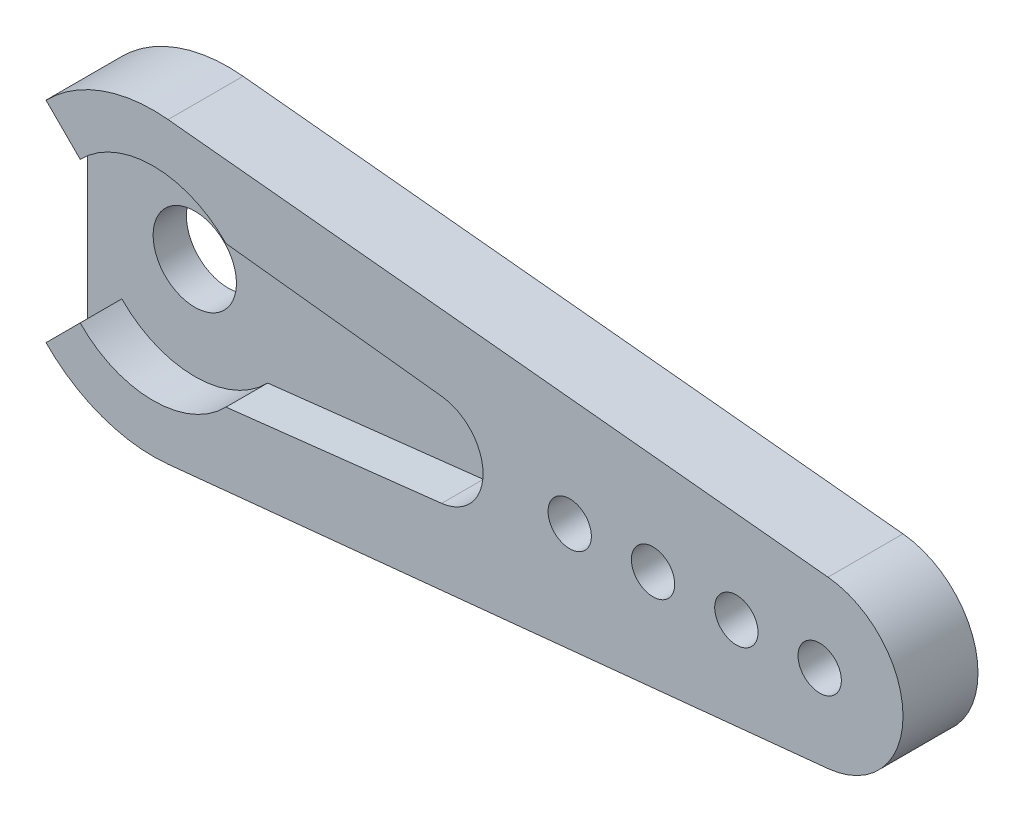
ISO-10303-21;
HEADER;
FILE_DESCRIPTION(('STEP AP214'),'2;1');
FILE_NAME('part.step','',(''),(''),'','','');
FILE_SCHEMA(('AUTOMOTIVE_DESIGN { 1 0 10303 214 1 1 1 1 }'));
ENDSEC;
DATA;
#1=APPLICATION_CONTEXT('core data for automotive mechanical design processes');
#2=APPLICATION_PROTOCOL_DEFINITION('international standard','automotive_design',2000,#1);
#3=PRODUCT_CONTEXT('',#1,'mechanical');
#4=PRODUCT('Part','Part','',(#3));
#5=PRODUCT_RELATED_PRODUCT_CATEGORY('part','',(#4));
#6=PRODUCT_DEFINITION_FORMATION('','',#4);
#7=PRODUCT_DEFINITION_CONTEXT('part definition',#1,'design');
#8=PRODUCT_DEFINITION('design','',#6,#7);
#9=PRODUCT_DEFINITION_SHAPE('','',#8);
#10=(LENGTH_UNIT() NAMED_UNIT(*) SI_UNIT(.MILLI.,.METRE.));
#11=(NAMED_UNIT(*) PLANE_ANGLE_UNIT() SI_UNIT($,.RADIAN.));
#12=(NAMED_UNIT(*) SI_UNIT($,.STERADIAN.) SOLID_ANGLE_UNIT());
#13=UNCERTAINTY_MEASURE_WITH_UNIT(LENGTH_MEASURE(1.E-05),#10,'distance_accuracy_value','');
#14=(GEOMETRIC_REPRESENTATION_CONTEXT(3) GLOBAL_UNCERTAINTY_ASSIGNED_CONTEXT((#13)) GLOBAL_UNIT_ASSIGNED_CONTEXT((#10,
#11,#12)) REPRESENTATION_CONTEXT('',''));
#15=CARTESIAN_POINT('',(0.,0.,0.));
#16=DIRECTION('',(0.,0.,1.));
#17=DIRECTION('',(1.,0.,0.));
#18=AXIS2_PLACEMENT_3D('',#15,#16,#17);
#19=CARTESIAN_POINT('',(25.,0.,-2.));
#20=DIRECTION('',(0.,0.,1.));
#21=DIRECTION('',(1.,0.,0.));
#22=AXIS2_PLACEMENT_3D('',#19,#20,#21);
#23=CYLINDRICAL_SURFACE('',#22,1.3);
#24=CARTESIAN_POINT('',(25.,0.,-2.));
#25=DIRECTION('',(0.,0.,1.));
#26=DIRECTION('',(1.,0.,0.));
#27=AXIS2_PLACEMENT_3D('',#24,#25,#26);
#28=CIRCLE('',#27,1.3);
#29=CARTESIAN_POINT('',(26.3,0.,-2.));
#30=VERTEX_POINT('',#29);
#31=EDGE_CURVE('E40',#30,#30,#28,.T.);
#32=ORIENTED_EDGE('',*,*,#31,.F.);
#33=EDGE_LOOP('',(#32));
#34=FACE_BOUND('',#33,.T.);
#35=CARTESIAN_POINT('',(25.,0.,2.5));
#36=DIRECTION('',(0.,0.,1.));
#37=DIRECTION('',(1.,0.,0.));
#38=AXIS2_PLACEMENT_3D('',#35,#36,#37);
#39=CIRCLE('',#38,1.3);
#40=CARTESIAN_POINT('',(26.3,0.,2.5));
#41=VERTEX_POINT('',#40);
#42=EDGE_CURVE('E11',#41,#41,#39,.T.);
#43=ORIENTED_EDGE('',*,*,#42,.T.);
#44=EDGE_LOOP('',(#43));
#45=FACE_BOUND('',#44,.T.);
#46=ADVANCED_FACE('F32',(#34,#45),#23,.F.);
#47=CARTESIAN_POINT('',(30.,0.,-2.));
#48=DIRECTION('',(0.,0.,1.));
#49=DIRECTION('',(1.,0.,0.));
#50=AXIS2_PLACEMENT_3D('',#47,#48,#49);
#51=CYLINDRICAL_SURFACE('',#50,1.3);
#52=CARTESIAN_POINT('',(30.,0.,-2.));
#53=DIRECTION('',(0.,0.,1.));
#54=DIRECTION('',(1.,0.,0.));
#55=AXIS2_PLACEMENT_3D('',#52,#53,#54);
#56=CIRCLE('',#55,1.3);
#57=CARTESIAN_POINT('',(31.3,0.,-2.));
#58=VERTEX_POINT('',#57);
#59=EDGE_CURVE('E230',#58,#58,#56,.T.);
#60=ORIENTED_EDGE('',*,*,#59,.F.);
#61=EDGE_LOOP('',(#60));
#62=FACE_BOUND('',#61,.T.);
#63=CARTESIAN_POINT('',(30.,0.,2.5));
#64=DIRECTION('',(0.,0.,1.));
#65=DIRECTION('',(1.,0.,0.));
#66=AXIS2_PLACEMENT_3D('',#63,#64,#65);
#67=CIRCLE('',#66,1.3);
#68=CARTESIAN_POINT('',(31.3,0.,2.5));
#69=VERTEX_POINT('',#68);
#70=EDGE_CURVE('E233',#69,#69,#67,.T.);
#71=ORIENTED_EDGE('',*,*,#70,.T.);
#72=EDGE_LOOP('',(#71));
#73=FACE_BOUND('',#72,.T.);
#74=ADVANCED_FACE('F241',(#62,#73),#51,.F.);
#75=CARTESIAN_POINT('',(0.,0.,2.5));
#76=DIRECTION('',(0.,0.,-1.));
#77=DIRECTION('',(-1.,0.,0.));
#78=AXIS2_PLACEMENT_3D('',#75,#76,#77);
#79=CYLINDRICAL_SURFACE('',#78,9.);
#80=DIRECTION('',(0.,0.,-1.));
#81=VECTOR('',#80,1.);
#82=CARTESIAN_POINT('',(0.900000000000001,8.95488693395958,2.5));
#83=LINE('',#82,#81);
#84=CARTESIAN_POINT('',(0.900000000000001,8.95488693395958,2.5));
#85=VERTEX_POINT('',#84);
#86=CARTESIAN_POINT('',(0.900000000000001,8.95488693395958,-2.));
#87=VERTEX_POINT('',#86);
#88=EDGE_CURVE('E184',#85,#87,#83,.T.);
#89=ORIENTED_EDGE('',*,*,#88,.T.);
#90=CARTESIAN_POINT('',(0.,0.,-2.));
#91=DIRECTION('',(0.,0.,-1.));
#92=DIRECTION('',(-1.,0.,0.));
#93=AXIS2_PLACEMENT_3D('',#90,#91,#92);
#94=CIRCLE('',#93,9.);
#95=CARTESIAN_POINT('',(-6.42654307097902,6.30075742723457,-2.));
#96=VERTEX_POINT('',#95);
#97=EDGE_CURVE('E134',#96,#87,#94,.T.);
#98=ORIENTED_EDGE('',*,*,#97,.F.);
#99=DIRECTION('',(0.,0.,1.));
#100=VECTOR('',#99,1.);
#101=CARTESIAN_POINT('',(-6.42654307097902,6.30075742723457,-2.));
#102=LINE('',#101,#100);
#103=CARTESIAN_POINT('',(-6.42654307097902,6.30075742723457,0.));
#104=VERTEX_POINT('',#103);
#105=EDGE_CURVE('E130',#96,#104,#102,.T.);
#106=ORIENTED_EDGE('',*,*,#105,.T.);
#107=DIRECTION('',(0.,0.,-1.));
#108=VECTOR('',#107,1.);
#109=CARTESIAN_POINT('',(-6.42654307097901,6.30075742723457,2.5));
#110=LINE('',#109,#108);
#111=CARTESIAN_POINT('',(-6.42654307097901,6.30075742723457,2.5));
#112=VERTEX_POINT('',#111);
#113=EDGE_CURVE('E227',#112,#104,#110,.T.);
#114=ORIENTED_EDGE('',*,*,#113,.F.);
#115=CARTESIAN_POINT('',(0.,0.,2.5));
#116=DIRECTION('',(0.,0.,1.));
#117=DIRECTION('',(-1.,0.,0.));
#118=AXIS2_PLACEMENT_3D('',#115,#116,#117);
#119=CIRCLE('',#118,9.);
#120=EDGE_CURVE('E161',#85,#112,#119,.T.);
#121=ORIENTED_EDGE('',*,*,#120,.F.);
#122=EDGE_LOOP('',(#89,#98,#106,#114,#121));
#123=FACE_BOUND('',#122,.T.);
#124=ADVANCED_FACE('F300',(#123),#79,.T.);
#125=CARTESIAN_POINT('',(-4.37578564374445,4.25,2.5));
#126=DIRECTION('',(0.707106781186548,0.707106781186548,0.));
#127=DIRECTION('',(-0.707106781186548,0.707106781186548,0.));
#128=AXIS2_PLACEMENT_3D('',#125,#126,#127);
#129=PLANE('',#128);
#130=DIRECTION('',(0.707106781186548,-0.707106781186548,0.));
#131=VECTOR('',#130,1.);
#132=CARTESIAN_POINT('',(-4.37578564374445,4.25,0.));
#133=LINE('',#132,#131);
#134=CARTESIAN_POINT('',(-4.37578564374445,4.25,0.));
#135=VERTEX_POINT('',#134);
#136=EDGE_CURVE('E153',#104,#135,#133,.T.);
#137=ORIENTED_EDGE('',*,*,#136,.T.);
#138=DIRECTION('',(0.,0.,-1.));
#139=VECTOR('',#138,1.);
#140=CARTESIAN_POINT('',(-4.37578564374445,4.25,2.5));
#141=LINE('',#140,#139);
#142=CARTESIAN_POINT('',(-4.37578564374445,4.25,2.5));
#143=VERTEX_POINT('',#142);
#144=EDGE_CURVE('E224',#143,#135,#141,.T.);
#145=ORIENTED_EDGE('',*,*,#144,.F.);
#146=DIRECTION('',(0.707106781186548,-0.707106781186548,0.));
#147=VECTOR('',#146,1.);
#148=CARTESIAN_POINT('',(-4.37578564374445,4.25,2.5));
#149=LINE('',#148,#147);
#150=EDGE_CURVE('E163',#112,#143,#149,.T.);
#151=ORIENTED_EDGE('',*,*,#150,.F.);
#152=ORIENTED_EDGE('',*,*,#113,.T.);
#153=EDGE_LOOP('',(#137,#145,#151,#152));
#154=FACE_BOUND('',#153,.T.);
#155=ADVANCED_FACE('F296',(#154),#129,.F.);
#156=CARTESIAN_POINT('',(0.,0.,2.5));
#157=DIRECTION('',(0.,0.,-1.));
#158=DIRECTION('',(-1.,0.,0.));
#159=AXIS2_PLACEMENT_3D('',#156,#157,#158);
#160=CYLINDRICAL_SURFACE('',#159,6.1);
#161=CARTESIAN_POINT('',(0.,0.,0.));
#162=DIRECTION('',(0.,0.,-1.));
#163=DIRECTION('',(1.,0.,0.));
#164=AXIS2_PLACEMENT_3D('',#161,#162,#163);
#165=CIRCLE('',#164,6.1);
#166=CARTESIAN_POINT('',(4.37578564374445,4.25,0.));
#167=VERTEX_POINT('',#166);
#168=EDGE_CURVE('E156',#135,#167,#165,.T.);
#169=ORIENTED_EDGE('',*,*,#168,.T.);
#170=DIRECTION('',(0.,0.,-1.));
#171=VECTOR('',#170,1.);
#172=CARTESIAN_POINT('',(4.37578564374445,4.25,2.5));
#173=LINE('',#172,#171);
#174=CARTESIAN_POINT('',(4.37578564374445,4.25,2.5));
#175=VERTEX_POINT('',#174);
#176=EDGE_CURVE('E221',#175,#167,#173,.T.);
#177=ORIENTED_EDGE('',*,*,#176,.F.);
#178=CARTESIAN_POINT('',(0.,0.,2.5));
#179=DIRECTION('',(0.,0.,-1.));
#180=DIRECTION('',(1.,0.,0.));
#181=AXIS2_PLACEMENT_3D('',#178,#179,#180);
#182=CIRCLE('',#181,6.1);
#183=EDGE_CURVE('E166',#143,#175,#182,.T.);
#184=ORIENTED_EDGE('',*,*,#183,.F.);
#185=ORIENTED_EDGE('',*,*,#144,.T.);
#186=EDGE_LOOP('',(#169,#177,#184,#185));
#187=FACE_BOUND('',#186,.T.);
#188=ADVANCED_FACE('F292',(#187),#160,.F.);
#189=CARTESIAN_POINT('',(4.37578564374445,4.25,2.5));
#190=DIRECTION('',(0.112713317991759,0.993627549913592,0.));
#191=DIRECTION('',(-0.993627549913592,0.112713317991759,0.));
#192=AXIS2_PLACEMENT_3D('',#189,#190,#191);
#193=PLANE('',#192);
#194=DIRECTION('',(0.993627549913592,-0.112713317991759,0.));
#195=VECTOR('',#194,1.);
#196=CARTESIAN_POINT('',(4.37578564374445,4.25,0.));
#197=LINE('',#196,#195);
#198=CARTESIAN_POINT('',(17.3155972903769,2.78215713975806,0.));
#199=VERTEX_POINT('',#198);
#200=EDGE_CURVE('E188',#167,#199,#197,.T.);
#201=ORIENTED_EDGE('',*,*,#200,.T.);
#202=DIRECTION('',(0.,0.,-1.));
#203=VECTOR('',#202,1.);
#204=CARTESIAN_POINT('',(17.3155972903769,2.78215713975806,2.5));
#205=LINE('',#204,#203);
#206=CARTESIAN_POINT('',(17.3155972903769,2.78215713975806,2.5));
#207=VERTEX_POINT('',#206);
#208=EDGE_CURVE('E218',#207,#199,#205,.T.);
#209=ORIENTED_EDGE('',*,*,#208,.F.);
#210=DIRECTION('',(0.993627549913592,-0.112713317991759,0.));
#211=VECTOR('',#210,1.);
#212=CARTESIAN_POINT('',(4.37578564374445,4.25,2.5));
#213=LINE('',#212,#211);
#214=EDGE_CURVE('E168',#175,#207,#213,.T.);
#215=ORIENTED_EDGE('',*,*,#214,.F.);
#216=ORIENTED_EDGE('',*,*,#176,.T.);
#217=EDGE_LOOP('',(#201,#209,#215,#216));
#218=FACE_BOUND('',#217,.T.);
#219=ADVANCED_FACE('F288',(#218),#193,.F.);
#220=CARTESIAN_POINT('',(17.,0.,2.5));
#221=DIRECTION('',(0.,0.,-1.));
#222=DIRECTION('',(-1.,0.,0.));
#223=AXIS2_PLACEMENT_3D('',#220,#221,#222);
#224=CYLINDRICAL_SURFACE('',#223,2.8);
#225=CARTESIAN_POINT('',(17.,0.,0.));
#226=DIRECTION('',(0.,0.,-1.));
#227=DIRECTION('',(1.,0.,0.));
#228=AXIS2_PLACEMENT_3D('',#225,#226,#227);
#229=CIRCLE('',#228,2.8);
#230=CARTESIAN_POINT('',(17.3155972903769,-2.78215713975806,0.));
#231=VERTEX_POINT('',#230);
#232=EDGE_CURVE('E191',#199,#231,#229,.T.);
#233=ORIENTED_EDGE('',*,*,#232,.T.);
#234=DIRECTION('',(0.,0.,-1.));
#235=VECTOR('',#234,1.);
#236=CARTESIAN_POINT('',(17.3155972903769,-2.78215713975806,2.5));
#237=LINE('',#236,#235);
#238=CARTESIAN_POINT('',(17.3155972903769,-2.78215713975806,2.5));
#239=VERTEX_POINT('',#238);
#240=EDGE_CURVE('E215',#239,#231,#237,.T.);
#241=ORIENTED_EDGE('',*,*,#240,.F.);
#242=CARTESIAN_POINT('',(17.,0.,2.5));
#243=DIRECTION('',(0.,0.,-1.));
#244=DIRECTION('',(1.,0.,0.));
#245=AXIS2_PLACEMENT_3D('',#242,#243,#244);
#246=CIRCLE('',#245,2.8);
#247=EDGE_CURVE('E170',#207,#239,#246,.T.);
#248=ORIENTED_EDGE('',*,*,#247,.F.);
#249=ORIENTED_EDGE('',*,*,#208,.T.);
#250=EDGE_LOOP('',(#233,#241,#248,#249));
#251=FACE_BOUND('',#250,.T.);
#252=ADVANCED_FACE('F284',(#251),#224,.F.);
#253=CARTESIAN_POINT('',(17.3155972903769,-2.78215713975806,2.5));
#254=DIRECTION('',(0.112713317991759,-0.993627549913592,0.));
#255=DIRECTION('',(0.993627549913592,0.112713317991759,0.));
#256=AXIS2_PLACEMENT_3D('',#253,#254,#255);
#257=PLANE('',#256);
#258=DIRECTION('',(-0.993627549913592,-0.112713317991759,0.));
#259=VECTOR('',#258,1.);
#260=CARTESIAN_POINT('',(17.3155972903769,-2.78215713975806,0.));
#261=LINE('',#260,#259);
#262=CARTESIAN_POINT('',(4.37578564374445,-4.25,0.));
#263=VERTEX_POINT('',#262);
#264=EDGE_CURVE('E194',#231,#263,#261,.T.);
#265=ORIENTED_EDGE('',*,*,#264,.T.);
#266=DIRECTION('',(0.,0.,-1.));
#267=VECTOR('',#266,1.);
#268=CARTESIAN_POINT('',(4.37578564374445,-4.25,2.5));
#269=LINE('',#268,#267);
#270=CARTESIAN_POINT('',(4.37578564374445,-4.25,2.5));
#271=VERTEX_POINT('',#270);
#272=EDGE_CURVE('E212',#271,#263,#269,.T.);
#273=ORIENTED_EDGE('',*,*,#272,.F.);
#274=DIRECTION('',(-0.993627549913592,-0.112713317991759,0.));
#275=VECTOR('',#274,1.);
#276=CARTESIAN_POINT('',(17.3155972903769,-2.78215713975806,2.5));
#277=LINE('',#276,#275);
#278=EDGE_CURVE('E172',#239,#271,#277,.T.);
#279=ORIENTED_EDGE('',*,*,#278,.F.);
#280=ORIENTED_EDGE('',*,*,#240,.T.);
#281=EDGE_LOOP('',(#265,#273,#279,#280));
#282=FACE_BOUND('',#281,.T.);
#283=ADVANCED_FACE('F280',(#282),#257,.F.);
#284=CARTESIAN_POINT('',(0.,0.,2.5));
#285=DIRECTION('',(0.,0.,-1.));
#286=DIRECTION('',(-1.,0.,0.));
#287=AXIS2_PLACEMENT_3D('',#284,#285,#286);
#288=CYLINDRICAL_SURFACE('',#287,6.1);
#289=CARTESIAN_POINT('',(0.,0.,0.));
#290=DIRECTION('',(0.,0.,-1.));
#291=DIRECTION('',(-1.,0.,0.));
#292=AXIS2_PLACEMENT_3D('',#289,#290,#291);
#293=CIRCLE('',#292,6.1);
#294=CARTESIAN_POINT('',(-4.37578564374444,-4.25,0.));
#295=VERTEX_POINT('',#294);
#296=EDGE_CURVE('E197',#263,#295,#293,.T.);
#297=ORIENTED_EDGE('',*,*,#296,.T.);
#298=DIRECTION('',(0.,0.,-1.));
#299=VECTOR('',#298,1.);
#300=CARTESIAN_POINT('',(-4.37578564374444,-4.25,2.5));
#301=LINE('',#300,#299);
#302=CARTESIAN_POINT('',(-4.37578564374444,-4.25,2.5));
#303=VERTEX_POINT('',#302);
#304=EDGE_CURVE('E209',#303,#295,#301,.T.);
#305=ORIENTED_EDGE('',*,*,#304,.F.);
#306=CARTESIAN_POINT('',(0.,0.,2.5));
#307=DIRECTION('',(0.,0.,-1.));
#308=DIRECTION('',(-1.,0.,0.));
#309=AXIS2_PLACEMENT_3D('',#306,#307,#308);
#310=CIRCLE('',#309,6.1);
#311=EDGE_CURVE('E174',#271,#303,#310,.T.);
#312=ORIENTED_EDGE('',*,*,#311,.F.);
#313=ORIENTED_EDGE('',*,*,#272,.T.);
#314=EDGE_LOOP('',(#297,#305,#312,#313));
#315=FACE_BOUND('',#314,.T.);
#316=ADVANCED_FACE('F276',(#315),#288,.F.);
#317=CARTESIAN_POINT('',(-4.37578564374445,-4.25,2.5));
#318=DIRECTION('',(0.707106781186548,-0.707106781186548,0.));
#319=DIRECTION('',(0.707106781186548,0.707106781186548,0.));
#320=AXIS2_PLACEMENT_3D('',#317,#318,#319);
#321=PLANE('',#320);
#322=DIRECTION('',(-0.707106781186548,-0.707106781186548,0.));
#323=VECTOR('',#322,1.);
#324=CARTESIAN_POINT('',(-4.37578564374445,-4.25,0.));
#325=LINE('',#324,#323);
#326=CARTESIAN_POINT('',(-6.42654307097901,-6.30075742723457,0.));
#327=VERTEX_POINT('',#326);
#328=EDGE_CURVE('E164',#295,#327,#325,.T.);
#329=ORIENTED_EDGE('',*,*,#328,.T.);
#330=DIRECTION('',(0.,0.,-1.));
#331=VECTOR('',#330,1.);
#332=CARTESIAN_POINT('',(-6.42654307097901,-6.30075742723457,2.5));
#333=LINE('',#332,#331);
#334=CARTESIAN_POINT('',(-6.42654307097901,-6.30075742723457,2.5));
#335=VERTEX_POINT('',#334);
#336=EDGE_CURVE('E152',#335,#327,#333,.T.);
#337=ORIENTED_EDGE('',*,*,#336,.F.);
#338=DIRECTION('',(-0.707106781186548,-0.707106781186548,0.));
#339=VECTOR('',#338,1.);
#340=CARTESIAN_POINT('',(-4.37578564374445,-4.25,2.5));
#341=LINE('',#340,#339);
#342=EDGE_CURVE('E176',#303,#335,#341,.T.);
#343=ORIENTED_EDGE('',*,*,#342,.F.);
#344=ORIENTED_EDGE('',*,*,#304,.T.);
#345=EDGE_LOOP('',(#329,#337,#343,#344));
#346=FACE_BOUND('',#345,.T.);
#347=ADVANCED_FACE('F273',(#346),#321,.F.);
#348=CARTESIAN_POINT('',(0.,0.,2.5));
#349=DIRECTION('',(0.,0.,-1.));
#350=DIRECTION('',(-1.,0.,0.));
#351=AXIS2_PLACEMENT_3D('',#348,#349,#350);
#352=CYLINDRICAL_SURFACE('',#351,9.);
#353=ORIENTED_EDGE('',*,*,#336,.T.);
#354=DIRECTION('',(0.,0.,1.));
#355=VECTOR('',#354,1.);
#356=CARTESIAN_POINT('',(-6.42654307097901,-6.30075742723457,-2.));
#357=LINE('',#356,#355);
#358=CARTESIAN_POINT('',(-6.42654307097901,-6.30075742723457,-2.));
#359=VERTEX_POINT('',#358);
#360=EDGE_CURVE('E127',#359,#327,#357,.T.);
#361=ORIENTED_EDGE('',*,*,#360,.F.);
#362=CARTESIAN_POINT('',(0.,0.,-2.));
#363=DIRECTION('',(0.,0.,-1.));
#364=DIRECTION('',(-1.,0.,0.));
#365=AXIS2_PLACEMENT_3D('',#362,#363,#364);
#366=CIRCLE('',#365,9.);
#367=CARTESIAN_POINT('',(0.9,-8.95488693395958,-2.));
#368=VERTEX_POINT('',#367);
#369=EDGE_CURVE('E135',#368,#359,#366,.T.);
#370=ORIENTED_EDGE('',*,*,#369,.F.);
#371=DIRECTION('',(0.,0.,-1.));
#372=VECTOR('',#371,1.);
#373=CARTESIAN_POINT('',(0.899999999999998,-8.95488693395958,2.5));
#374=LINE('',#373,#372);
#375=CARTESIAN_POINT('',(0.899999999999998,-8.95488693395958,2.5));
#376=VERTEX_POINT('',#375);
#377=EDGE_CURVE('E206',#376,#368,#374,.T.);
#378=ORIENTED_EDGE('',*,*,#377,.F.);
#379=CARTESIAN_POINT('',(0.,0.,2.5));
#380=DIRECTION('',(0.,0.,1.));
#381=DIRECTION('',(1.,0.,0.));
#382=AXIS2_PLACEMENT_3D('',#379,#380,#381);
#383=CIRCLE('',#382,9.);
#384=EDGE_CURVE('E178',#335,#376,#383,.T.);
#385=ORIENTED_EDGE('',*,*,#384,.F.);
#386=EDGE_LOOP('',(#353,#361,#370,#378,#385));
#387=FACE_BOUND('',#386,.T.);
#388=ADVANCED_FACE('F149',(#387),#352,.T.);
#389=CARTESIAN_POINT('',(0.9,-8.95488693395958,2.5));
#390=DIRECTION('',(-0.1,0.99498743710662,0.));
#391=DIRECTION('',(-0.99498743710662,-0.1,0.));
#392=AXIS2_PLACEMENT_3D('',#389,#390,#391);
#393=PLANE('',#392);
#394=ORIENTED_EDGE('',*,*,#377,.T.);
#395=DIRECTION('',(-0.99498743710662,-0.1,0.));
#396=VECTOR('',#395,1.);
#397=CARTESIAN_POINT('',(0.9,-8.95488693395958,-2.));
#398=LINE('',#397,#396);
#399=CARTESIAN_POINT('',(40.5,-4.9749371855331,-2.));
#400=VERTEX_POINT('',#399);
#401=EDGE_CURVE('E143',#400,#368,#398,.T.);
#402=ORIENTED_EDGE('',*,*,#401,.F.);
#403=DIRECTION('',(0.,0.,-1.));
#404=VECTOR('',#403,1.);
#405=CARTESIAN_POINT('',(40.5,-4.9749371855331,2.5));
#406=LINE('',#405,#404);
#407=CARTESIAN_POINT('',(40.5,-4.9749371855331,2.5));
#408=VERTEX_POINT('',#407);
#409=EDGE_CURVE('E204',#408,#400,#406,.T.);
#410=ORIENTED_EDGE('',*,*,#409,.F.);
#411=DIRECTION('',(0.99498743710662,0.1,0.));
#412=VECTOR('',#411,1.);
#413=CARTESIAN_POINT('',(0.9,-8.95488693395958,2.5));
#414=LINE('',#413,#412);
#415=EDGE_CURVE('E180',#376,#408,#414,.T.);
#416=ORIENTED_EDGE('',*,*,#415,.F.);
#417=EDGE_LOOP('',(#394,#402,#410,#416));
#418=FACE_BOUND('',#417,.T.);
#419=ADVANCED_FACE('F266',(#418),#393,.F.);
#420=CARTESIAN_POINT('',(40.,0.,2.5));
#421=DIRECTION('',(0.,0.,-1.));
#422=DIRECTION('',(-1.,0.,0.));
#423=AXIS2_PLACEMENT_3D('',#420,#421,#422);
#424=CYLINDRICAL_SURFACE('',#423,5.);
#425=ORIENTED_EDGE('',*,*,#409,.T.);
#426=CARTESIAN_POINT('',(40.,0.,-2.));
#427=DIRECTION('',(0.,0.,-1.));
#428=DIRECTION('',(-1.,0.,0.));
#429=AXIS2_PLACEMENT_3D('',#426,#427,#428);
#430=CIRCLE('',#429,5.);
#431=CARTESIAN_POINT('',(40.5,4.9749371855331,-2.));
#432=VERTEX_POINT('',#431);
#433=EDGE_CURVE('E493',#432,#400,#430,.T.);
#434=ORIENTED_EDGE('',*,*,#433,.F.);
#435=DIRECTION('',(0.,0.,-1.));
#436=VECTOR('',#435,1.);
#437=CARTESIAN_POINT('',(40.5,4.9749371855331,2.5));
#438=LINE('',#437,#436);
#439=CARTESIAN_POINT('',(40.5,4.9749371855331,2.5));
#440=VERTEX_POINT('',#439);
#441=EDGE_CURVE('E202',#440,#432,#438,.T.);
#442=ORIENTED_EDGE('',*,*,#441,.F.);
#443=CARTESIAN_POINT('',(40.,0.,2.5));
#444=DIRECTION('',(0.,0.,1.));
#445=DIRECTION('',(-1.,0.,0.));
#446=AXIS2_PLACEMENT_3D('',#443,#444,#445);
#447=CIRCLE('',#446,5.);
#448=EDGE_CURVE('E182',#408,#440,#447,.T.);
#449=ORIENTED_EDGE('',*,*,#448,.F.);
#450=EDGE_LOOP('',(#425,#434,#442,#449));
#451=FACE_BOUND('',#450,.T.);
#452=ADVANCED_FACE('F256',(#451),#424,.T.);
#453=CARTESIAN_POINT('',(0.900000000000001,8.95488693395958,2.5));
#454=DIRECTION('',(-0.1,-0.99498743710662,0.));
#455=DIRECTION('',(0.99498743710662,-0.1,0.));
#456=AXIS2_PLACEMENT_3D('',#453,#454,#455);
#457=PLANE('',#456);
#458=ORIENTED_EDGE('',*,*,#441,.T.);
#459=DIRECTION('',(0.99498743710662,-0.1,0.));
#460=VECTOR('',#459,1.);
#461=CARTESIAN_POINT('',(0.900000000000001,8.95488693395958,-2.));
#462=LINE('',#461,#460);
#463=EDGE_CURVE('E490',#87,#432,#462,.T.);
#464=ORIENTED_EDGE('',*,*,#463,.F.);
#465=ORIENTED_EDGE('',*,*,#88,.F.);
#466=DIRECTION('',(-0.99498743710662,0.1,0.));
#467=VECTOR('',#466,1.);
#468=CARTESIAN_POINT('',(0.900000000000001,8.95488693395958,2.5));
#469=LINE('',#468,#467);
#470=EDGE_CURVE('E47',#440,#85,#469,.T.);
#471=ORIENTED_EDGE('',*,*,#470,.F.);
#472=EDGE_LOOP('',(#458,#464,#465,#471));
#473=FACE_BOUND('',#472,.T.);
#474=ADVANCED_FACE('F246',(#473),#457,.F.);
#475=CARTESIAN_POINT('',(0.,0.,2.5));
#476=DIRECTION('',(0.,0.,-1.));
#477=DIRECTION('',(-1.,0.,0.));
#478=AXIS2_PLACEMENT_3D('',#475,#476,#477);
#479=PLANE('',#478);
#480=CARTESIAN_POINT('',(35.,0.,2.5));
#481=DIRECTION('',(0.,0.,1.));
#482=DIRECTION('',(1.,0.,0.));
#483=AXIS2_PLACEMENT_3D('',#480,#481,#482);
#484=CIRCLE('',#483,1.3);
#485=CARTESIAN_POINT('',(36.3,0.,2.5));
#486=VERTEX_POINT('',#485);
#487=EDGE_CURVE('E473',#486,#486,#484,.T.);
#488=ORIENTED_EDGE('',*,*,#487,.F.);
#489=EDGE_LOOP('',(#488));
#490=FACE_BOUND('',#489,.T.);
#491=CARTESIAN_POINT('',(40.,0.,2.5));
#492=DIRECTION('',(0.,0.,1.));
#493=DIRECTION('',(1.,0.,0.));
#494=AXIS2_PLACEMENT_3D('',#491,#492,#493);
#495=CIRCLE('',#494,1.3);
#496=CARTESIAN_POINT('',(41.3,0.,2.5));
#497=VERTEX_POINT('',#496);
#498=EDGE_CURVE('E474',#497,#497,#495,.T.);
#499=ORIENTED_EDGE('',*,*,#498,.F.);
#500=EDGE_LOOP('',(#499));
#501=FACE_BOUND('',#500,.T.);
#502=ORIENTED_EDGE('',*,*,#120,.T.);
#503=ORIENTED_EDGE('',*,*,#150,.T.);
#504=ORIENTED_EDGE('',*,*,#183,.T.);
#505=ORIENTED_EDGE('',*,*,#214,.T.);
#506=ORIENTED_EDGE('',*,*,#247,.T.);
#507=ORIENTED_EDGE('',*,*,#278,.T.);
#508=ORIENTED_EDGE('',*,*,#311,.T.);
#509=ORIENTED_EDGE('',*,*,#342,.T.);
#510=ORIENTED_EDGE('',*,*,#384,.T.);
#511=ORIENTED_EDGE('',*,*,#415,.T.);
#512=ORIENTED_EDGE('',*,*,#448,.T.);
#513=ORIENTED_EDGE('',*,*,#470,.T.);
#514=EDGE_LOOP('',(#502,#503,#504,#505,#506,#507,#508,#509,#510,#511,#512,#513));
#515=FACE_BOUND('',#514,.T.);
#516=ORIENTED_EDGE('',*,*,#70,.F.);
#517=EDGE_LOOP('',(#516));
#518=FACE_BOUND('',#517,.T.);
#519=ORIENTED_EDGE('',*,*,#42,.F.);
#520=EDGE_LOOP('',(#519));
#521=FACE_BOUND('',#520,.T.);
#522=ADVANCED_FACE('F244',(#490,#501,#515,#518,#521),#479,.F.);
#523=CARTESIAN_POINT('',(0.,0.,-2.));
#524=DIRECTION('',(0.,0.,-1.));
#525=DIRECTION('',(-1.,0.,0.));
#526=AXIS2_PLACEMENT_3D('',#523,#524,#525);
#527=PLANE('',#526);
#528=CARTESIAN_POINT('',(35.,0.,-2.));
#529=DIRECTION('',(0.,0.,1.));
#530=DIRECTION('',(1.,0.,0.));
#531=AXIS2_PLACEMENT_3D('',#528,#529,#530);
#532=CIRCLE('',#531,1.3);
#533=CARTESIAN_POINT('',(36.3,0.,-2.));
#534=VERTEX_POINT('',#533);
#535=EDGE_CURVE('E471',#534,#534,#532,.T.);
#536=ORIENTED_EDGE('',*,*,#535,.T.);
#537=EDGE_LOOP('',(#536));
#538=FACE_BOUND('',#537,.T.);
#539=CARTESIAN_POINT('',(40.,0.,-2.));
#540=DIRECTION('',(0.,0.,1.));
#541=DIRECTION('',(1.,0.,0.));
#542=AXIS2_PLACEMENT_3D('',#539,#540,#541);
#543=CIRCLE('',#542,1.3);
#544=CARTESIAN_POINT('',(41.3,0.,-2.));
#545=VERTEX_POINT('',#544);
#546=EDGE_CURVE('E477',#545,#545,#543,.T.);
#547=ORIENTED_EDGE('',*,*,#546,.T.);
#548=EDGE_LOOP('',(#547));
#549=FACE_BOUND('',#548,.T.);
#550=ORIENTED_EDGE('',*,*,#369,.T.);
#551=DIRECTION('',(0.,1.,0.));
#552=VECTOR('',#551,1.);
#553=CARTESIAN_POINT('',(-6.42654307097901,-6.30075742723457,-2.));
#554=LINE('',#553,#552);
#555=EDGE_CURVE('E122',#359,#96,#554,.T.);
#556=ORIENTED_EDGE('',*,*,#555,.T.);
#557=ORIENTED_EDGE('',*,*,#97,.T.);
#558=ORIENTED_EDGE('',*,*,#463,.T.);
#559=ORIENTED_EDGE('',*,*,#433,.T.);
#560=ORIENTED_EDGE('',*,*,#401,.T.);
#561=EDGE_LOOP('',(#550,#556,#557,#558,#559,#560));
#562=FACE_BOUND('',#561,.T.);
#563=CARTESIAN_POINT('',(0.,0.,-2.));
#564=DIRECTION('',(0.,0.,-1.));
#565=DIRECTION('',(-1.,0.,0.));
#566=AXIS2_PLACEMENT_3D('',#563,#564,#565);
#567=CIRCLE('',#566,2.5);
#568=CARTESIAN_POINT('',(-2.5,0.,-2.));
#569=VERTEX_POINT('',#568);
#570=EDGE_CURVE('E484',#569,#569,#567,.T.);
#571=ORIENTED_EDGE('',*,*,#570,.F.);
#572=EDGE_LOOP('',(#571));
#573=FACE_BOUND('',#572,.T.);
#574=ORIENTED_EDGE('',*,*,#59,.T.);
#575=EDGE_LOOP('',(#574));
#576=FACE_BOUND('',#575,.T.);
#577=ORIENTED_EDGE('',*,*,#31,.T.);
#578=EDGE_LOOP('',(#577));
#579=FACE_BOUND('',#578,.T.);
#580=ADVANCED_FACE('F139',(#538,#549,#562,#573,#576,#579),#527,.T.);
#581=CARTESIAN_POINT('',(0.,0.,0.));
#582=DIRECTION('',(0.,0.,-1.));
#583=DIRECTION('',(-1.,0.,0.));
#584=AXIS2_PLACEMENT_3D('',#581,#582,#583);
#585=PLANE('',#584);
#586=ORIENTED_EDGE('',*,*,#328,.F.);
#587=ORIENTED_EDGE('',*,*,#296,.F.);
#588=ORIENTED_EDGE('',*,*,#264,.F.);
#589=ORIENTED_EDGE('',*,*,#232,.F.);
#590=ORIENTED_EDGE('',*,*,#200,.F.);
#591=ORIENTED_EDGE('',*,*,#168,.F.);
#592=ORIENTED_EDGE('',*,*,#136,.F.);
#593=DIRECTION('',(0.,1.,0.));
#594=VECTOR('',#593,1.);
#595=CARTESIAN_POINT('',(-6.42654307097901,-6.30075742723457,0.));
#596=LINE('',#595,#594);
#597=EDGE_CURVE('E146',#327,#104,#596,.T.);
#598=ORIENTED_EDGE('',*,*,#597,.F.);
#599=EDGE_LOOP('',(#586,#587,#588,#589,#590,#591,#592,#598));
#600=FACE_BOUND('',#599,.T.);
#601=CARTESIAN_POINT('',(0.,0.,0.));
#602=DIRECTION('',(0.,0.,-1.));
#603=DIRECTION('',(-1.,0.,0.));
#604=AXIS2_PLACEMENT_3D('',#601,#602,#603);
#605=CIRCLE('',#604,2.5);
#606=CARTESIAN_POINT('',(-2.5,0.,0.));
#607=VERTEX_POINT('',#606);
#608=EDGE_CURVE('E482',#607,#607,#605,.T.);
#609=ORIENTED_EDGE('',*,*,#608,.T.);
#610=EDGE_LOOP('',(#609));
#611=FACE_BOUND('',#610,.T.);
#612=ADVANCED_FACE('F253',(#600,#611),#585,.F.);
#613=CARTESIAN_POINT('',(-6.42654307097901,-6.30075742723457,-2.));
#614=DIRECTION('',(1.,0.,0.));
#615=DIRECTION('',(0.,0.,-1.));
#616=AXIS2_PLACEMENT_3D('',#613,#614,#615);
#617=PLANE('',#616);
#618=ORIENTED_EDGE('',*,*,#597,.T.);
#619=ORIENTED_EDGE('',*,*,#105,.F.);
#620=ORIENTED_EDGE('',*,*,#555,.F.);
#621=ORIENTED_EDGE('',*,*,#360,.T.);
#622=EDGE_LOOP('',(#618,#619,#620,#621));
#623=FACE_BOUND('',#622,.T.);
#624=ADVANCED_FACE('F125',(#623),#617,.F.);
#625=CARTESIAN_POINT('',(0.,0.,-2.));
#626=DIRECTION('',(0.,0.,1.));
#627=DIRECTION('',(1.,0.,0.));
#628=AXIS2_PLACEMENT_3D('',#625,#626,#627);
#629=CYLINDRICAL_SURFACE('',#628,2.5);
#630=ORIENTED_EDGE('',*,*,#570,.T.);
#631=EDGE_LOOP('',(#630));
#632=FACE_BOUND('',#631,.T.);
#633=ORIENTED_EDGE('',*,*,#608,.F.);
#634=EDGE_LOOP('',(#633));
#635=FACE_BOUND('',#634,.T.);
#636=ADVANCED_FACE('F382',(#632,#635),#629,.F.);
#637=CARTESIAN_POINT('',(40.,0.,-2.));
#638=DIRECTION('',(0.,0.,1.));
#639=DIRECTION('',(1.,0.,0.));
#640=AXIS2_PLACEMENT_3D('',#637,#638,#639);
#641=CYLINDRICAL_SURFACE('',#640,1.3);
#642=ORIENTED_EDGE('',*,*,#546,.F.);
#643=EDGE_LOOP('',(#642));
#644=FACE_BOUND('',#643,.T.);
#645=ORIENTED_EDGE('',*,*,#498,.T.);
#646=EDGE_LOOP('',(#645));
#647=FACE_BOUND('',#646,.T.);
#648=ADVANCED_FACE('F390',(#644,#647),#641,.F.);
#649=CARTESIAN_POINT('',(35.,0.,-2.));
#650=DIRECTION('',(0.,0.,1.));
#651=DIRECTION('',(1.,0.,0.));
#652=AXIS2_PLACEMENT_3D('',#649,#650,#651);
#653=CYLINDRICAL_SURFACE('',#652,1.3);
#654=ORIENTED_EDGE('',*,*,#535,.F.);
#655=EDGE_LOOP('',(#654));
#656=FACE_BOUND('',#655,.T.);
#657=ORIENTED_EDGE('',*,*,#487,.T.);
#658=EDGE_LOOP('',(#657));
#659=FACE_BOUND('',#658,.T.);
#660=ADVANCED_FACE('F399',(#656,#659),#653,.F.);
#661=CLOSED_SHELL('',(#46,#74,#124,#155,#188,#219,#252,#283,#316,#347,#388,#419,#452,#474,#522,
#580,#612,#624,#636,#648,#660));
#662=MANIFOLD_SOLID_BREP('B2',#661);
#663=ADVANCED_BREP_SHAPE_REPRESENTATION('',(#18,#662),#14);
#664=SHAPE_DEFINITION_REPRESENTATION(#9,#663);
ENDSEC;
END-ISO-10303-21;
